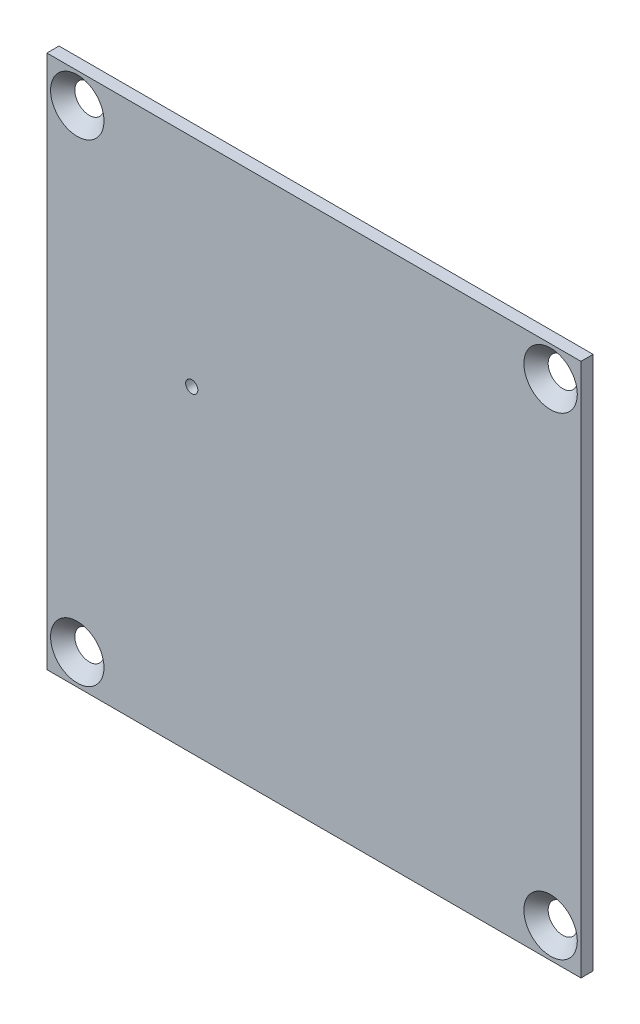
ISO-10303-21;
HEADER;
FILE_DESCRIPTION(('STEP AP214'),'2;1');
FILE_NAME('part.step','',(''),(''),'','','');
FILE_SCHEMA(('AUTOMOTIVE_DESIGN { 1 0 10303 214 1 1 1 1 }'));
ENDSEC;
DATA;
#1=APPLICATION_CONTEXT('core data for automotive mechanical design processes');
#2=APPLICATION_PROTOCOL_DEFINITION('international standard','automotive_design',2000,#1);
#3=PRODUCT_CONTEXT('',#1,'mechanical');
#4=PRODUCT('Part','Part','',(#3));
#5=PRODUCT_RELATED_PRODUCT_CATEGORY('part','',(#4));
#6=PRODUCT_DEFINITION_FORMATION('','',#4);
#7=PRODUCT_DEFINITION_CONTEXT('part definition',#1,'design');
#8=PRODUCT_DEFINITION('design','',#6,#7);
#9=PRODUCT_DEFINITION_SHAPE('','',#8);
#10=(LENGTH_UNIT() NAMED_UNIT(*) SI_UNIT(.MILLI.,.METRE.));
#11=(NAMED_UNIT(*) PLANE_ANGLE_UNIT() SI_UNIT($,.RADIAN.));
#12=(NAMED_UNIT(*) SI_UNIT($,.STERADIAN.) SOLID_ANGLE_UNIT());
#13=UNCERTAINTY_MEASURE_WITH_UNIT(LENGTH_MEASURE(1.E-05),#10,'distance_accuracy_value','');
#14=(GEOMETRIC_REPRESENTATION_CONTEXT(3) GLOBAL_UNCERTAINTY_ASSIGNED_CONTEXT((#13)) GLOBAL_UNIT_ASSIGNED_CONTEXT((#10,
#11,#12)) REPRESENTATION_CONTEXT('',''));
#15=CARTESIAN_POINT('',(0.,0.,0.));
#16=DIRECTION('',(0.,0.,1.));
#17=DIRECTION('',(1.,0.,0.));
#18=AXIS2_PLACEMENT_3D('',#15,#16,#17);
#19=CARTESIAN_POINT('',(22.,22.,1.));
#20=DIRECTION('',(0.,-1.,0.));
#21=DIRECTION('',(0.,0.,-1.));
#22=AXIS2_PLACEMENT_3D('',#19,#20,#21);
#23=PLANE('',#22);
#24=DIRECTION('',(-1.,0.,0.));
#25=VECTOR('',#24,1.);
#26=CARTESIAN_POINT('',(22.,22.,0.));
#27=LINE('',#26,#25);
#28=CARTESIAN_POINT('',(22.,22.,0.));
#29=VERTEX_POINT('',#28);
#30=CARTESIAN_POINT('',(-22.,22.,0.));
#31=VERTEX_POINT('',#30);
#32=EDGE_CURVE('E115',#29,#31,#27,.T.);
#33=ORIENTED_EDGE('',*,*,#32,.T.);
#34=DIRECTION('',(0.,0.,-1.));
#35=VECTOR('',#34,1.);
#36=CARTESIAN_POINT('',(-22.,22.,1.));
#37=LINE('',#36,#35);
#38=CARTESIAN_POINT('',(-22.,22.,1.));
#39=VERTEX_POINT('',#38);
#40=EDGE_CURVE('E11',#39,#31,#37,.T.);
#41=ORIENTED_EDGE('',*,*,#40,.F.);
#42=DIRECTION('',(-1.,0.,0.));
#43=VECTOR('',#42,1.);
#44=CARTESIAN_POINT('',(22.,22.,1.));
#45=LINE('',#44,#43);
#46=CARTESIAN_POINT('',(22.,22.,1.));
#47=VERTEX_POINT('',#46);
#48=EDGE_CURVE('E99',#47,#39,#45,.T.);
#49=ORIENTED_EDGE('',*,*,#48,.F.);
#50=DIRECTION('',(0.,0.,-1.));
#51=VECTOR('',#50,1.);
#52=CARTESIAN_POINT('',(22.,22.,1.));
#53=LINE('',#52,#51);
#54=EDGE_CURVE('E111',#47,#29,#53,.T.);
#55=ORIENTED_EDGE('',*,*,#54,.T.);
#56=EDGE_LOOP('',(#33,#41,#49,#55));
#57=FACE_BOUND('',#56,.T.);
#58=ADVANCED_FACE('F47',(#57),#23,.F.);
#59=CARTESIAN_POINT('',(-22.,-22.,1.));
#60=DIRECTION('',(1.,0.,0.));
#61=DIRECTION('',(0.,0.,-1.));
#62=AXIS2_PLACEMENT_3D('',#59,#60,#61);
#63=PLANE('',#62);
#64=DIRECTION('',(0.,-1.,0.));
#65=VECTOR('',#64,1.);
#66=CARTESIAN_POINT('',(-22.,-22.,0.));
#67=LINE('',#66,#65);
#68=CARTESIAN_POINT('',(-22.,-22.,0.));
#69=VERTEX_POINT('',#68);
#70=EDGE_CURVE('E104',#31,#69,#67,.T.);
#71=ORIENTED_EDGE('',*,*,#70,.T.);
#72=DIRECTION('',(0.,0.,-1.));
#73=VECTOR('',#72,1.);
#74=CARTESIAN_POINT('',(-22.,-22.,1.));
#75=LINE('',#74,#73);
#76=CARTESIAN_POINT('',(-22.,-22.,1.));
#77=VERTEX_POINT('',#76);
#78=EDGE_CURVE('E56',#77,#69,#75,.T.);
#79=ORIENTED_EDGE('',*,*,#78,.F.);
#80=DIRECTION('',(0.,-1.,0.));
#81=VECTOR('',#80,1.);
#82=CARTESIAN_POINT('',(-22.,-22.,1.));
#83=LINE('',#82,#81);
#84=EDGE_CURVE('E94',#39,#77,#83,.T.);
#85=ORIENTED_EDGE('',*,*,#84,.F.);
#86=ORIENTED_EDGE('',*,*,#40,.T.);
#87=EDGE_LOOP('',(#71,#79,#85,#86));
#88=FACE_BOUND('',#87,.T.);
#89=ADVANCED_FACE('F103',(#88),#63,.F.);
#90=CARTESIAN_POINT('',(22.,-22.,1.));
#91=DIRECTION('',(0.,1.,0.));
#92=DIRECTION('',(0.,0.,1.));
#93=AXIS2_PLACEMENT_3D('',#90,#91,#92);
#94=PLANE('',#93);
#95=DIRECTION('',(1.,0.,0.));
#96=VECTOR('',#95,1.);
#97=CARTESIAN_POINT('',(22.,-22.,0.));
#98=LINE('',#97,#96);
#99=CARTESIAN_POINT('',(22.,-22.,0.));
#100=VERTEX_POINT('',#99);
#101=EDGE_CURVE('E81',#69,#100,#98,.T.);
#102=ORIENTED_EDGE('',*,*,#101,.T.);
#103=DIRECTION('',(0.,0.,-1.));
#104=VECTOR('',#103,1.);
#105=CARTESIAN_POINT('',(22.,-22.,1.));
#106=LINE('',#105,#104);
#107=CARTESIAN_POINT('',(22.,-22.,1.));
#108=VERTEX_POINT('',#107);
#109=EDGE_CURVE('E106',#108,#100,#106,.T.);
#110=ORIENTED_EDGE('',*,*,#109,.F.);
#111=DIRECTION('',(1.,0.,0.));
#112=VECTOR('',#111,1.);
#113=CARTESIAN_POINT('',(22.,-22.,1.));
#114=LINE('',#113,#112);
#115=EDGE_CURVE('E97',#77,#108,#114,.T.);
#116=ORIENTED_EDGE('',*,*,#115,.F.);
#117=ORIENTED_EDGE('',*,*,#78,.T.);
#118=EDGE_LOOP('',(#102,#110,#116,#117));
#119=FACE_BOUND('',#118,.T.);
#120=ADVANCED_FACE('F107',(#119),#94,.F.);
#121=CARTESIAN_POINT('',(22.,-22.,1.));
#122=DIRECTION('',(-1.,0.,0.));
#123=DIRECTION('',(0.,0.,1.));
#124=AXIS2_PLACEMENT_3D('',#121,#122,#123);
#125=PLANE('',#124);
#126=DIRECTION('',(0.,1.,0.));
#127=VECTOR('',#126,1.);
#128=CARTESIAN_POINT('',(22.,-22.,0.));
#129=LINE('',#128,#127);
#130=EDGE_CURVE('E87',#100,#29,#129,.T.);
#131=ORIENTED_EDGE('',*,*,#130,.T.);
#132=ORIENTED_EDGE('',*,*,#54,.F.);
#133=DIRECTION('',(0.,1.,0.));
#134=VECTOR('',#133,1.);
#135=CARTESIAN_POINT('',(22.,-22.,1.));
#136=LINE('',#135,#134);
#137=EDGE_CURVE('E64',#108,#47,#136,.T.);
#138=ORIENTED_EDGE('',*,*,#137,.F.);
#139=ORIENTED_EDGE('',*,*,#109,.T.);
#140=EDGE_LOOP('',(#131,#132,#138,#139));
#141=FACE_BOUND('',#140,.T.);
#142=ADVANCED_FACE('F129',(#141),#125,.F.);
#143=CARTESIAN_POINT('',(0.,0.,1.));
#144=DIRECTION('',(0.,0.,-1.));
#145=DIRECTION('',(-1.,0.,0.));
#146=AXIS2_PLACEMENT_3D('',#143,#144,#145);
#147=PLANE('',#146);
#148=CARTESIAN_POINT('',(19.5,-19.5,1.));
#149=DIRECTION('',(0.,0.,1.));
#150=DIRECTION('',(1.,0.,0.));
#151=AXIS2_PLACEMENT_3D('',#148,#149,#150);
#152=CIRCLE('',#151,2.2);
#153=CARTESIAN_POINT('',(21.7,-19.5,1.));
#154=VERTEX_POINT('',#153);
#155=EDGE_CURVE('E171',#154,#154,#152,.T.);
#156=ORIENTED_EDGE('',*,*,#155,.F.);
#157=EDGE_LOOP('',(#156));
#158=FACE_BOUND('',#157,.T.);
#159=CARTESIAN_POINT('',(-19.5,-19.5,1.));
#160=DIRECTION('',(0.,0.,1.));
#161=DIRECTION('',(1.,0.,0.));
#162=AXIS2_PLACEMENT_3D('',#159,#160,#161);
#163=CIRCLE('',#162,2.2);
#164=CARTESIAN_POINT('',(-17.3,-19.5,1.));
#165=VERTEX_POINT('',#164);
#166=EDGE_CURVE('E163',#165,#165,#163,.T.);
#167=ORIENTED_EDGE('',*,*,#166,.F.);
#168=EDGE_LOOP('',(#167));
#169=FACE_BOUND('',#168,.T.);
#170=CARTESIAN_POINT('',(-19.5,19.5,1.));
#171=DIRECTION('',(0.,0.,1.));
#172=DIRECTION('',(1.,0.,0.));
#173=AXIS2_PLACEMENT_3D('',#170,#171,#172);
#174=CIRCLE('',#173,2.2);
#175=CARTESIAN_POINT('',(-17.3,19.5,1.));
#176=VERTEX_POINT('',#175);
#177=EDGE_CURVE('E155',#176,#176,#174,.T.);
#178=ORIENTED_EDGE('',*,*,#177,.F.);
#179=EDGE_LOOP('',(#178));
#180=FACE_BOUND('',#179,.T.);
#181=CARTESIAN_POINT('',(19.5,19.5,1.));
#182=DIRECTION('',(0.,0.,1.));
#183=DIRECTION('',(1.,0.,0.));
#184=AXIS2_PLACEMENT_3D('',#181,#182,#183);
#185=CIRCLE('',#184,2.2);
#186=CARTESIAN_POINT('',(21.7,19.5,1.));
#187=VERTEX_POINT('',#186);
#188=EDGE_CURVE('E147',#187,#187,#185,.T.);
#189=ORIENTED_EDGE('',*,*,#188,.F.);
#190=EDGE_LOOP('',(#189));
#191=FACE_BOUND('',#190,.T.);
#192=CARTESIAN_POINT('',(-10.0676540105553,4.16018437454113,1.));
#193=DIRECTION('',(0.,0.,1.));
#194=DIRECTION('',(1.,0.,0.));
#195=AXIS2_PLACEMENT_3D('',#192,#193,#194);
#196=CIRCLE('',#195,0.500000000000001);
#197=CARTESIAN_POINT('',(-9.56765401055532,4.16018437454113,1.));
#198=VERTEX_POINT('',#197);
#199=EDGE_CURVE('E136',#198,#198,#196,.T.);
#200=ORIENTED_EDGE('',*,*,#199,.F.);
#201=EDGE_LOOP('',(#200));
#202=FACE_BOUND('',#201,.T.);
#203=ORIENTED_EDGE('',*,*,#48,.T.);
#204=ORIENTED_EDGE('',*,*,#84,.T.);
#205=ORIENTED_EDGE('',*,*,#115,.T.);
#206=ORIENTED_EDGE('',*,*,#137,.T.);
#207=EDGE_LOOP('',(#203,#204,#205,#206));
#208=FACE_BOUND('',#207,.T.);
#209=ADVANCED_FACE('F95',(#158,#169,#180,#191,#202,#208),#147,.F.);
#210=CARTESIAN_POINT('',(0.,0.,0.));
#211=DIRECTION('',(0.,0.,-1.));
#212=DIRECTION('',(-1.,0.,0.));
#213=AXIS2_PLACEMENT_3D('',#210,#211,#212);
#214=PLANE('',#213);
#215=CARTESIAN_POINT('',(19.5,-19.5,0.));
#216=DIRECTION('',(0.,0.,1.));
#217=DIRECTION('',(1.,0.,0.));
#218=AXIS2_PLACEMENT_3D('',#215,#216,#217);
#219=CIRCLE('',#218,1.2);
#220=CARTESIAN_POINT('',(20.7,-19.5,0.));
#221=VERTEX_POINT('',#220);
#222=EDGE_CURVE('E167',#221,#221,#219,.T.);
#223=ORIENTED_EDGE('',*,*,#222,.T.);
#224=EDGE_LOOP('',(#223));
#225=FACE_BOUND('',#224,.T.);
#226=CARTESIAN_POINT('',(-19.5,-19.5,0.));
#227=DIRECTION('',(0.,0.,1.));
#228=DIRECTION('',(1.,0.,0.));
#229=AXIS2_PLACEMENT_3D('',#226,#227,#228);
#230=CIRCLE('',#229,1.2);
#231=CARTESIAN_POINT('',(-18.3,-19.5,0.));
#232=VERTEX_POINT('',#231);
#233=EDGE_CURVE('E159',#232,#232,#230,.T.);
#234=ORIENTED_EDGE('',*,*,#233,.T.);
#235=EDGE_LOOP('',(#234));
#236=FACE_BOUND('',#235,.T.);
#237=CARTESIAN_POINT('',(-19.5,19.5,0.));
#238=DIRECTION('',(0.,0.,1.));
#239=DIRECTION('',(1.,0.,0.));
#240=AXIS2_PLACEMENT_3D('',#237,#238,#239);
#241=CIRCLE('',#240,1.2);
#242=CARTESIAN_POINT('',(-18.3,19.5,0.));
#243=VERTEX_POINT('',#242);
#244=EDGE_CURVE('E151',#243,#243,#241,.T.);
#245=ORIENTED_EDGE('',*,*,#244,.T.);
#246=EDGE_LOOP('',(#245));
#247=FACE_BOUND('',#246,.T.);
#248=CARTESIAN_POINT('',(19.5,19.5,0.));
#249=DIRECTION('',(0.,0.,1.));
#250=DIRECTION('',(1.,0.,0.));
#251=AXIS2_PLACEMENT_3D('',#248,#249,#250);
#252=CIRCLE('',#251,1.2);
#253=CARTESIAN_POINT('',(20.7,19.5,0.));
#254=VERTEX_POINT('',#253);
#255=EDGE_CURVE('E140',#254,#254,#252,.T.);
#256=ORIENTED_EDGE('',*,*,#255,.T.);
#257=EDGE_LOOP('',(#256));
#258=FACE_BOUND('',#257,.T.);
#259=CARTESIAN_POINT('',(-10.0676540105553,4.16018437454113,0.));
#260=DIRECTION('',(0.,0.,1.));
#261=DIRECTION('',(1.,0.,0.));
#262=AXIS2_PLACEMENT_3D('',#259,#260,#261);
#263=CIRCLE('',#262,0.500000000000001);
#264=CARTESIAN_POINT('',(-9.56765401055532,4.16018437454113,0.));
#265=VERTEX_POINT('',#264);
#266=EDGE_CURVE('E119',#265,#265,#263,.T.);
#267=ORIENTED_EDGE('',*,*,#266,.T.);
#268=EDGE_LOOP('',(#267));
#269=FACE_BOUND('',#268,.T.);
#270=ORIENTED_EDGE('',*,*,#32,.F.);
#271=ORIENTED_EDGE('',*,*,#130,.F.);
#272=ORIENTED_EDGE('',*,*,#101,.F.);
#273=ORIENTED_EDGE('',*,*,#70,.F.);
#274=EDGE_LOOP('',(#270,#271,#272,#273));
#275=FACE_BOUND('',#274,.T.);
#276=ADVANCED_FACE('F132',(#225,#236,#247,#258,#269,#275),#214,.T.);
#277=CARTESIAN_POINT('',(-10.0676540105553,4.16018437454113,0.));
#278=DIRECTION('',(0.,0.,1.));
#279=DIRECTION('',(1.,0.,0.));
#280=AXIS2_PLACEMENT_3D('',#277,#278,#279);
#281=CYLINDRICAL_SURFACE('',#280,0.500000000000001);
#282=ORIENTED_EDGE('',*,*,#266,.F.);
#283=EDGE_LOOP('',(#282));
#284=FACE_BOUND('',#283,.T.);
#285=ORIENTED_EDGE('',*,*,#199,.T.);
#286=EDGE_LOOP('',(#285));
#287=FACE_BOUND('',#286,.T.);
#288=ADVANCED_FACE('F189',(#284,#287),#281,.F.);
#289=CARTESIAN_POINT('',(19.5,19.5,1.));
#290=DIRECTION('',(0.,0.,1.));
#291=DIRECTION('',(1.,0.,0.));
#292=AXIS2_PLACEMENT_3D('',#289,#290,#291);
#293=CONICAL_SURFACE('',#292,2.2,0.785398163397447);
#294=ORIENTED_EDGE('',*,*,#255,.F.);
#295=EDGE_LOOP('',(#294));
#296=FACE_BOUND('',#295,.T.);
#297=ORIENTED_EDGE('',*,*,#188,.T.);
#298=EDGE_LOOP('',(#297));
#299=FACE_BOUND('',#298,.T.);
#300=ADVANCED_FACE('F191',(#296,#299),#293,.F.);
#301=CARTESIAN_POINT('',(-19.5,19.5,1.));
#302=DIRECTION('',(0.,0.,1.));
#303=DIRECTION('',(1.,0.,0.));
#304=AXIS2_PLACEMENT_3D('',#301,#302,#303);
#305=CONICAL_SURFACE('',#304,2.2,0.785398163397447);
#306=ORIENTED_EDGE('',*,*,#244,.F.);
#307=EDGE_LOOP('',(#306));
#308=FACE_BOUND('',#307,.T.);
#309=ORIENTED_EDGE('',*,*,#177,.T.);
#310=EDGE_LOOP('',(#309));
#311=FACE_BOUND('',#310,.T.);
#312=ADVANCED_FACE('F199',(#308,#311),#305,.F.);
#313=CARTESIAN_POINT('',(-19.5,-19.5,1.));
#314=DIRECTION('',(0.,0.,1.));
#315=DIRECTION('',(1.,0.,0.));
#316=AXIS2_PLACEMENT_3D('',#313,#314,#315);
#317=CONICAL_SURFACE('',#316,2.2,0.785398163397447);
#318=ORIENTED_EDGE('',*,*,#233,.F.);
#319=EDGE_LOOP('',(#318));
#320=FACE_BOUND('',#319,.T.);
#321=ORIENTED_EDGE('',*,*,#166,.T.);
#322=EDGE_LOOP('',(#321));
#323=FACE_BOUND('',#322,.T.);
#324=ADVANCED_FACE('F268',(#320,#323),#317,.F.);
#325=CARTESIAN_POINT('',(19.5,-19.5,1.));
#326=DIRECTION('',(0.,0.,1.));
#327=DIRECTION('',(1.,0.,0.));
#328=AXIS2_PLACEMENT_3D('',#325,#326,#327);
#329=CONICAL_SURFACE('',#328,2.2,0.785398163397447);
#330=ORIENTED_EDGE('',*,*,#222,.F.);
#331=EDGE_LOOP('',(#330));
#332=FACE_BOUND('',#331,.T.);
#333=ORIENTED_EDGE('',*,*,#155,.T.);
#334=EDGE_LOOP('',(#333));
#335=FACE_BOUND('',#334,.T.);
#336=ADVANCED_FACE('F176',(#332,#335),#329,.F.);
#337=CLOSED_SHELL('',(#58,#89,#120,#142,#209,#276,#288,#300,#312,#324,#336));
#338=MANIFOLD_SOLID_BREP('B2',#337);
#339=ADVANCED_BREP_SHAPE_REPRESENTATION('',(#18,#338),#14);
#340=SHAPE_DEFINITION_REPRESENTATION(#9,#339);
ENDSEC;
END-ISO-10303-21;
